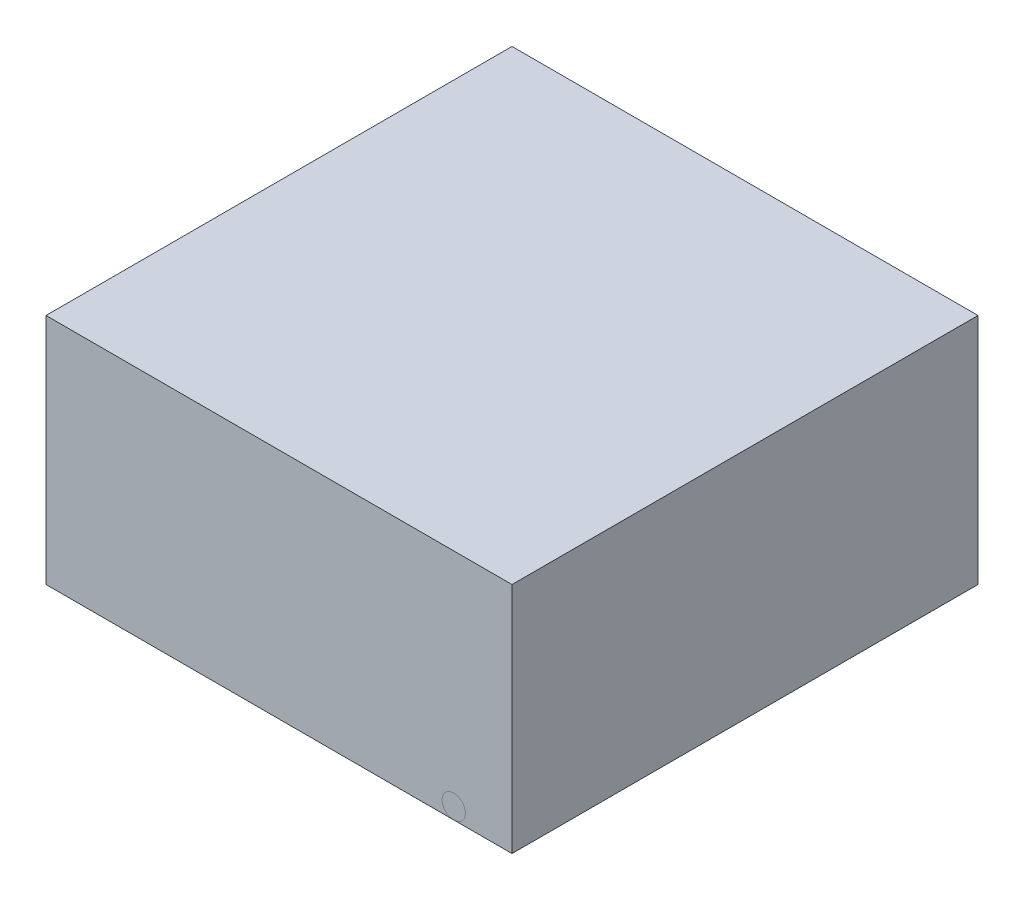
ISO-10303-21;
HEADER;
FILE_DESCRIPTION(('STEP AP214'),'2;1');
FILE_NAME('part.step','',(''),(''),'','','');
FILE_SCHEMA(('AUTOMOTIVE_DESIGN { 1 0 10303 214 1 1 1 1 }'));
ENDSEC;
DATA;
#1=APPLICATION_CONTEXT('core data for automotive mechanical design processes');
#2=APPLICATION_PROTOCOL_DEFINITION('international standard','automotive_design',2000,#1);
#3=PRODUCT_CONTEXT('',#1,'mechanical');
#4=PRODUCT('Part','Part','',(#3));
#5=PRODUCT_RELATED_PRODUCT_CATEGORY('part','',(#4));
#6=PRODUCT_DEFINITION_FORMATION('','',#4);
#7=PRODUCT_DEFINITION_CONTEXT('part definition',#1,'design');
#8=PRODUCT_DEFINITION('design','',#6,#7);
#9=PRODUCT_DEFINITION_SHAPE('','',#8);
#10=(LENGTH_UNIT() NAMED_UNIT(*) SI_UNIT(.MILLI.,.METRE.));
#11=(NAMED_UNIT(*) PLANE_ANGLE_UNIT() SI_UNIT($,.RADIAN.));
#12=(NAMED_UNIT(*) SI_UNIT($,.STERADIAN.) SOLID_ANGLE_UNIT());
#13=UNCERTAINTY_MEASURE_WITH_UNIT(LENGTH_MEASURE(1.E-05),#10,'distance_accuracy_value','');
#14=(GEOMETRIC_REPRESENTATION_CONTEXT(3) GLOBAL_UNCERTAINTY_ASSIGNED_CONTEXT((#13)) GLOBAL_UNIT_ASSIGNED_CONTEXT((#10,
#11,#12)) REPRESENTATION_CONTEXT('',''));
#15=CARTESIAN_POINT('',(0.,0.,0.));
#16=DIRECTION('',(0.,0.,1.));
#17=DIRECTION('',(1.,0.,0.));
#18=AXIS2_PLACEMENT_3D('',#15,#16,#17);
#19=CARTESIAN_POINT('',(-1.32978682457797,-4.7,12.0470966404881));
#20=CARTESIAN_POINT('',(-1.56949938233388,-4.7,12.2405123536894));
#21=CARTESIAN_POINT('',(-2.08614424851907,-4.7,12.5391697720833));
#22=CARTESIAN_POINT('',(-1.58643209411403,-4.7,13.1168891119311));
#23=CARTESIAN_POINT('',(-0.99479110722871,-4.7,13.4609601521511));
#24=CARTESIAN_POINT('',(-0.122057096544853,-4.7,13.5063472457396));
#25=CARTESIAN_POINT('',(0.780549472015395,-4.7,13.1044677868928));
#26=CARTESIAN_POINT('',(2.65290980881673,-4.7,13.5718372621998));
#27=CARTESIAN_POINT('',(1.37260667116618,-4.7,11.7465735610997));
#28=CARTESIAN_POINT('',(0.251281573482777,-4.7,11.3225744749199));
#29=CARTESIAN_POINT('',(-0.824147776626975,-4.7,11.5489578340658));
#30=CARTESIAN_POINT('',(-1.19634203116918,-4.7,11.9394246848268));
#31=CARTESIAN_POINT('',(-1.32978682457797,-4.7,12.0470966404881));
#32=B_SPLINE_CURVE_WITH_KNOTS('',3,(#19,#20,#21,#22,#23,#24,#25,#26,#27,#28,#29,#30,#31),
.UNSPECIFIED.,.T.,.F.,(4,1,1,1,1,1,1,1,1,1,4),(0.,0.0890314863366276,0.133435272323839,
0.204833870138696,0.315562123210451,0.38661889368764,0.538438655581061,0.696738525235763,
0.817182112999442,0.95043735542146,1.),.UNSPECIFIED.);
#33=DIRECTION('',(0.,-1.,0.));
#34=VECTOR('',#33,1.);
#35=SURFACE_OF_LINEAR_EXTRUSION('',#32,#34);
#36=CARTESIAN_POINT('',(-1.32978682457797,-4.7,12.0470966404881));
#37=VERTEX_POINT('',#36);
#38=EDGE_CURVE('E11',#37,#37,#32,.T.);
#39=ORIENTED_EDGE('',*,*,#38,.F.);
#40=EDGE_LOOP('',(#39));
#41=FACE_BOUND('',#40,.T.);
#42=CARTESIAN_POINT('',(-1.32978682457797,-5.,12.0470966404881));
#43=CARTESIAN_POINT('',(-1.56949938233388,-5.,12.2405123536894));
#44=CARTESIAN_POINT('',(-2.08614424851907,-5.,12.5391697720833));
#45=CARTESIAN_POINT('',(-1.58643209411403,-5.,13.1168891119311));
#46=CARTESIAN_POINT('',(-0.99479110722871,-5.,13.4609601521511));
#47=CARTESIAN_POINT('',(-0.122057096544853,-5.,13.5063472457396));
#48=CARTESIAN_POINT('',(0.780549472015395,-5.,13.1044677868928));
#49=CARTESIAN_POINT('',(2.65290980881673,-5.,13.5718372621998));
#50=CARTESIAN_POINT('',(1.37260667116618,-5.,11.7465735610997));
#51=CARTESIAN_POINT('',(0.251281573482777,-5.,11.3225744749199));
#52=CARTESIAN_POINT('',(-0.824147776626975,-5.,11.5489578340658));
#53=CARTESIAN_POINT('',(-1.19634203116918,-5.,11.9394246848268));
#54=CARTESIAN_POINT('',(-1.32978682457797,-5.,12.0470966404881));
#55=B_SPLINE_CURVE_WITH_KNOTS('',3,(#42,#43,#44,#45,#46,#47,#48,#49,#50,#51,#52,#53,#54),
.UNSPECIFIED.,.T.,.F.,(4,1,1,1,1,1,1,1,1,1,4),(0.,0.0890314863366276,0.133435272323839,
0.204833870138696,0.315562123210451,0.38661889368764,0.538438655581061,0.696738525235763,
0.817182112999442,0.95043735542146,1.),.UNSPECIFIED.);
#56=CARTESIAN_POINT('',(-1.32978682457797,-5.,12.0470966404881));
#57=VERTEX_POINT('',#56);
#58=EDGE_CURVE('E43',#57,#57,#55,.T.);
#59=ORIENTED_EDGE('',*,*,#58,.T.);
#60=EDGE_LOOP('',(#59));
#61=FACE_BOUND('',#60,.T.);
#62=ADVANCED_FACE('F39',(#41,#61),#35,.F.);
#63=CARTESIAN_POINT('',(1.81422588975815,-4.7,13.257386496687));
#64=DIRECTION('',(0.,-1.,0.));
#65=DIRECTION('',(0.,0.,-1.));
#66=AXIS2_PLACEMENT_3D('',#63,#64,#65);
#67=PLANE('',#66);
#68=ORIENTED_EDGE('',*,*,#38,.T.);
#69=EDGE_LOOP('',(#68));
#70=FACE_BOUND('',#69,.T.);
#71=ADVANCED_FACE('F62',(#70),#67,.F.);
#72=CARTESIAN_POINT('',(1.81422588975815,-5.,13.257386496687));
#73=DIRECTION('',(0.,-1.,0.));
#74=DIRECTION('',(0.,0.,-1.));
#75=AXIS2_PLACEMENT_3D('',#72,#73,#74);
#76=PLANE('',#75);
#77=ORIENTED_EDGE('',*,*,#58,.F.);
#78=EDGE_LOOP('',(#77));
#79=FACE_BOUND('',#78,.T.);
#80=ADVANCED_FACE('F60',(#79),#76,.T.);
#81=CLOSED_SHELL('',(#62,#71,#80));
#82=MANIFOLD_SOLID_BREP('B2',#81);
#83=CARTESIAN_POINT('',(7.5,-4.5,20.));
#84=DIRECTION('',(0.,0.,-1.));
#85=DIRECTION('',(-1.,0.,0.));
#86=AXIS2_PLACEMENT_3D('',#83,#84,#85);
#87=PLANE('',#86);
#88=CARTESIAN_POINT('',(7.5,-4.5,20.));
#89=DIRECTION('',(0.,0.,1.));
#90=DIRECTION('',(-1.,0.,0.));
#91=AXIS2_PLACEMENT_3D('',#88,#89,#90);
#92=CIRCLE('',#91,0.500000000000002);
#93=CARTESIAN_POINT('',(7.,-4.5,20.));
#94=VERTEX_POINT('',#93);
#95=EDGE_CURVE('E112',#94,#94,#92,.T.);
#96=ORIENTED_EDGE('',*,*,#95,.T.);
#97=EDGE_LOOP('',(#96));
#98=FACE_BOUND('',#97,.T.);
#99=ADVANCED_FACE('F98',(#98),#87,.F.);
#100=CARTESIAN_POINT('',(7.5,5.,4.));
#101=DIRECTION('',(0.,1.,0.));
#102=DIRECTION('',(-1.,0.,0.));
#103=AXIS2_PLACEMENT_3D('',#100,#101,#102);
#104=PLANE('',#103);
#105=CARTESIAN_POINT('',(7.5,5.,4.));
#106=DIRECTION('',(0.,-1.,0.));
#107=DIRECTION('',(-1.,0.,0.));
#108=AXIS2_PLACEMENT_3D('',#105,#106,#107);
#109=CIRCLE('',#108,0.500000000000002);
#110=CARTESIAN_POINT('',(7.,5.,4.));
#111=VERTEX_POINT('',#110);
#112=EDGE_CURVE('E38',#111,#111,#109,.T.);
#113=ORIENTED_EDGE('',*,*,#112,.F.);
#114=EDGE_LOOP('',(#113));
#115=FACE_BOUND('',#114,.T.);
#116=ADVANCED_FACE('F122',(#115),#104,.T.);
#117=CARTESIAN_POINT('',(7.5,-4.5,20.));
#118=DIRECTION('',(0.,0.,-1.));
#119=DIRECTION('',(-1.,0.,0.));
#120=AXIS2_PLACEMENT_3D('',#117,#118,#119);
#121=CYLINDRICAL_SURFACE('',#120,0.500000000000002);
#122=CARTESIAN_POINT('',(7.5,-4.5,5.));
#123=DIRECTION('',(0.,0.,1.));
#124=DIRECTION('',(-1.,0.,0.));
#125=AXIS2_PLACEMENT_3D('',#122,#123,#124);
#126=CIRCLE('',#125,0.500000000000002);
#127=CARTESIAN_POINT('',(7.5,-5.,5.));
#128=VERTEX_POINT('',#127);
#129=EDGE_CURVE('E108',#128,#128,#126,.T.);
#130=ORIENTED_EDGE('',*,*,#129,.T.);
#131=EDGE_LOOP('',(#130));
#132=FACE_BOUND('',#131,.T.);
#133=ORIENTED_EDGE('',*,*,#95,.F.);
#134=EDGE_LOOP('',(#133));
#135=FACE_BOUND('',#134,.T.);
#136=ADVANCED_FACE('F119',(#132,#135),#121,.T.);
#137=CARTESIAN_POINT('',(7.5,-3.5,5.));
#138=DIRECTION('',(1.,0.,0.));
#139=DIRECTION('',(0.,0.,-1.));
#140=AXIS2_PLACEMENT_3D('',#137,#138,#139);
#141=TOROIDAL_SURFACE('',#140,1.,0.500000000000002);
#142=CARTESIAN_POINT('',(7.5,-3.5,4.));
#143=DIRECTION('',(0.,-1.,0.));
#144=DIRECTION('',(-1.,0.,0.));
#145=AXIS2_PLACEMENT_3D('',#142,#143,#144);
#146=CIRCLE('',#145,0.500000000000002);
#147=CARTESIAN_POINT('',(7.5,-3.5,3.5));
#148=VERTEX_POINT('',#147);
#149=EDGE_CURVE('E104',#148,#148,#146,.T.);
#150=CARTESIAN_POINT('',(7.5,-3.5,5.));
#151=DIRECTION('',(1.,0.,0.));
#152=DIRECTION('',(0.,0.,-1.));
#153=AXIS2_PLACEMENT_3D('',#150,#151,#152);
#154=CIRCLE('',#153,1.5);
#155=EDGE_CURVE('',#128,#148,#154,.T.);
#156=ORIENTED_EDGE('',*,*,#129,.F.);
#157=ORIENTED_EDGE('',*,*,#149,.T.);
#158=ORIENTED_EDGE('',*,*,#155,.T.);
#159=ORIENTED_EDGE('',*,*,#155,.F.);
#160=EDGE_LOOP('',(#156,#158,#157,#159));
#161=FACE_BOUND('',#160,.T.);
#162=ADVANCED_FACE('F121',(#161),#141,.T.);
#163=CARTESIAN_POINT('',(7.5,-3.5,4.));
#164=DIRECTION('',(0.,1.,0.));
#165=DIRECTION('',(0.,0.,1.));
#166=AXIS2_PLACEMENT_3D('',#163,#164,#165);
#167=CYLINDRICAL_SURFACE('',#166,0.500000000000002);
#168=ORIENTED_EDGE('',*,*,#112,.T.);
#169=EDGE_LOOP('',(#168));
#170=FACE_BOUND('',#169,.T.);
#171=ORIENTED_EDGE('',*,*,#149,.F.);
#172=EDGE_LOOP('',(#171));
#173=FACE_BOUND('',#172,.T.);
#174=ADVANCED_FACE('F129',(#170,#173),#167,.T.);
#175=CLOSED_SHELL('',(#99,#116,#136,#162,#174));
#176=MANIFOLD_SOLID_BREP('B6',#175);
#177=CARTESIAN_POINT('',(-7.5,-4.5,20.));
#178=DIRECTION('',(0.,0.,1.));
#179=DIRECTION('',(1.,0.,0.));
#180=AXIS2_PLACEMENT_3D('',#177,#178,#179);
#181=PLANE('',#180);
#182=CARTESIAN_POINT('',(-7.5,-4.5,20.));
#183=DIRECTION('',(0.,0.,1.));
#184=DIRECTION('',(1.,0.,0.));
#185=AXIS2_PLACEMENT_3D('',#182,#183,#184);
#186=CIRCLE('',#185,0.500000000000002);
#187=CARTESIAN_POINT('',(-7.,-4.5,20.));
#188=VERTEX_POINT('',#187);
#189=EDGE_CURVE('E191',#188,#188,#186,.T.);
#190=ORIENTED_EDGE('',*,*,#189,.T.);
#191=EDGE_LOOP('',(#190));
#192=FACE_BOUND('',#191,.T.);
#193=ADVANCED_FACE('F177',(#192),#181,.T.);
#194=CARTESIAN_POINT('',(-7.5,5.,4.));
#195=DIRECTION('',(0.,-1.,0.));
#196=DIRECTION('',(1.,0.,0.));
#197=AXIS2_PLACEMENT_3D('',#194,#195,#196);
#198=PLANE('',#197);
#199=CARTESIAN_POINT('',(-7.5,5.,4.));
#200=DIRECTION('',(0.,-1.,0.));
#201=DIRECTION('',(1.,0.,0.));
#202=AXIS2_PLACEMENT_3D('',#199,#200,#201);
#203=CIRCLE('',#202,0.500000000000002);
#204=CARTESIAN_POINT('',(-7.,5.,4.));
#205=VERTEX_POINT('',#204);
#206=EDGE_CURVE('E97',#205,#205,#203,.T.);
#207=ORIENTED_EDGE('',*,*,#206,.F.);
#208=EDGE_LOOP('',(#207));
#209=FACE_BOUND('',#208,.T.);
#210=ADVANCED_FACE('F201',(#209),#198,.F.);
#211=CARTESIAN_POINT('',(-7.5,-4.5,20.));
#212=DIRECTION('',(0.,0.,-1.));
#213=DIRECTION('',(-1.,0.,0.));
#214=AXIS2_PLACEMENT_3D('',#211,#212,#213);
#215=CYLINDRICAL_SURFACE('',#214,0.500000000000002);
#216=CARTESIAN_POINT('',(-7.5,-4.5,5.));
#217=DIRECTION('',(0.,0.,1.));
#218=DIRECTION('',(1.,0.,0.));
#219=AXIS2_PLACEMENT_3D('',#216,#217,#218);
#220=CIRCLE('',#219,0.500000000000002);
#221=CARTESIAN_POINT('',(-7.5,-5.,5.));
#222=VERTEX_POINT('',#221);
#223=EDGE_CURVE('E187',#222,#222,#220,.T.);
#224=ORIENTED_EDGE('',*,*,#223,.T.);
#225=EDGE_LOOP('',(#224));
#226=FACE_BOUND('',#225,.T.);
#227=ORIENTED_EDGE('',*,*,#189,.F.);
#228=EDGE_LOOP('',(#227));
#229=FACE_BOUND('',#228,.T.);
#230=ADVANCED_FACE('F198',(#226,#229),#215,.T.);
#231=CARTESIAN_POINT('',(-7.5,-3.5,5.));
#232=DIRECTION('',(1.,0.,0.));
#233=DIRECTION('',(0.,0.,-1.));
#234=AXIS2_PLACEMENT_3D('',#231,#232,#233);
#235=TOROIDAL_SURFACE('',#234,1.,0.500000000000002);
#236=CARTESIAN_POINT('',(-7.5,-3.5,4.));
#237=DIRECTION('',(0.,-1.,0.));
#238=DIRECTION('',(1.,0.,0.));
#239=AXIS2_PLACEMENT_3D('',#236,#237,#238);
#240=CIRCLE('',#239,0.500000000000002);
#241=CARTESIAN_POINT('',(-7.5,-3.5,3.5));
#242=VERTEX_POINT('',#241);
#243=EDGE_CURVE('E183',#242,#242,#240,.T.);
#244=CARTESIAN_POINT('',(-7.5,-3.5,5.));
#245=DIRECTION('',(1.,0.,0.));
#246=DIRECTION('',(0.,0.,-1.));
#247=AXIS2_PLACEMENT_3D('',#244,#245,#246);
#248=CIRCLE('',#247,1.5);
#249=EDGE_CURVE('',#222,#242,#248,.T.);
#250=ORIENTED_EDGE('',*,*,#223,.F.);
#251=ORIENTED_EDGE('',*,*,#243,.T.);
#252=ORIENTED_EDGE('',*,*,#249,.T.);
#253=ORIENTED_EDGE('',*,*,#249,.F.);
#254=EDGE_LOOP('',(#250,#252,#251,#253));
#255=FACE_BOUND('',#254,.T.);
#256=ADVANCED_FACE('F200',(#255),#235,.T.);
#257=CARTESIAN_POINT('',(-7.5,-3.5,4.));
#258=DIRECTION('',(0.,1.,0.));
#259=DIRECTION('',(0.,0.,1.));
#260=AXIS2_PLACEMENT_3D('',#257,#258,#259);
#261=CYLINDRICAL_SURFACE('',#260,0.500000000000002);
#262=ORIENTED_EDGE('',*,*,#206,.T.);
#263=EDGE_LOOP('',(#262));
#264=FACE_BOUND('',#263,.T.);
#265=ORIENTED_EDGE('',*,*,#243,.F.);
#266=EDGE_LOOP('',(#265));
#267=FACE_BOUND('',#266,.T.);
#268=ADVANCED_FACE('F208',(#264,#267),#261,.T.);
#269=CLOSED_SHELL('',(#193,#210,#230,#256,#268));
#270=MANIFOLD_SOLID_BREP('B33',#269);
#271=CARTESIAN_POINT('',(10.,-5.,20.));
#272=DIRECTION('',(-1.,0.,0.));
#273=DIRECTION('',(0.,0.,1.));
#274=AXIS2_PLACEMENT_3D('',#271,#272,#273);
#275=PLANE('',#274);
#276=DIRECTION('',(0.,1.,0.));
#277=VECTOR('',#276,1.);
#278=CARTESIAN_POINT('',(10.,-5.,0.));
#279=LINE('',#278,#277);
#280=CARTESIAN_POINT('',(10.,-5.,0.));
#281=VERTEX_POINT('',#280);
#282=CARTESIAN_POINT('',(10.,5.,0.));
#283=VERTEX_POINT('',#282);
#284=EDGE_CURVE('E310',#281,#283,#279,.T.);
#285=ORIENTED_EDGE('',*,*,#284,.T.);
#286=DIRECTION('',(0.,0.,-1.));
#287=VECTOR('',#286,1.);
#288=CARTESIAN_POINT('',(10.,5.,20.));
#289=LINE('',#288,#287);
#290=CARTESIAN_POINT('',(10.,5.,20.));
#291=VERTEX_POINT('',#290);
#292=EDGE_CURVE('E175',#291,#283,#289,.T.);
#293=ORIENTED_EDGE('',*,*,#292,.F.);
#294=DIRECTION('',(0.,1.,0.));
#295=VECTOR('',#294,1.);
#296=CARTESIAN_POINT('',(10.,-5.,20.));
#297=LINE('',#296,#295);
#298=CARTESIAN_POINT('',(10.,-5.,20.));
#299=VERTEX_POINT('',#298);
#300=EDGE_CURVE('E298',#299,#291,#297,.T.);
#301=ORIENTED_EDGE('',*,*,#300,.F.);
#302=DIRECTION('',(0.,0.,-1.));
#303=VECTOR('',#302,1.);
#304=CARTESIAN_POINT('',(10.,-5.,20.));
#305=LINE('',#304,#303);
#306=EDGE_CURVE('E306',#299,#281,#305,.T.);
#307=ORIENTED_EDGE('',*,*,#306,.T.);
#308=EDGE_LOOP('',(#285,#293,#301,#307));
#309=FACE_BOUND('',#308,.T.);
#310=ADVANCED_FACE('F247',(#309),#275,.F.);
#311=CARTESIAN_POINT('',(-10.,5.,20.));
#312=DIRECTION('',(0.,-1.,0.));
#313=DIRECTION('',(0.,0.,-1.));
#314=AXIS2_PLACEMENT_3D('',#311,#312,#313);
#315=PLANE('',#314);
#316=DIRECTION('',(-1.,0.,0.));
#317=VECTOR('',#316,1.);
#318=CARTESIAN_POINT('',(-10.,5.,0.));
#319=LINE('',#318,#317);
#320=CARTESIAN_POINT('',(-10.,5.,0.));
#321=VERTEX_POINT('',#320);
#322=EDGE_CURVE('E302',#283,#321,#319,.T.);
#323=ORIENTED_EDGE('',*,*,#322,.T.);
#324=DIRECTION('',(0.,0.,-1.));
#325=VECTOR('',#324,1.);
#326=CARTESIAN_POINT('',(-10.,5.,20.));
#327=LINE('',#326,#325);
#328=CARTESIAN_POINT('',(-10.,5.,20.));
#329=VERTEX_POINT('',#328);
#330=EDGE_CURVE('E255',#329,#321,#327,.T.);
#331=ORIENTED_EDGE('',*,*,#330,.F.);
#332=DIRECTION('',(-1.,0.,0.));
#333=VECTOR('',#332,1.);
#334=CARTESIAN_POINT('',(-10.,5.,20.));
#335=LINE('',#334,#333);
#336=EDGE_CURVE('E293',#291,#329,#335,.T.);
#337=ORIENTED_EDGE('',*,*,#336,.F.);
#338=ORIENTED_EDGE('',*,*,#292,.T.);
#339=EDGE_LOOP('',(#323,#331,#337,#338));
#340=FACE_BOUND('',#339,.T.);
#341=ADVANCED_FACE('F301',(#340),#315,.F.);
#342=CARTESIAN_POINT('',(-10.,-5.,20.));
#343=DIRECTION('',(1.,0.,0.));
#344=DIRECTION('',(0.,1.,0.));
#345=AXIS2_PLACEMENT_3D('',#342,#343,#344);
#346=PLANE('',#345);
#347=DIRECTION('',(0.,-1.,0.));
#348=VECTOR('',#347,1.);
#349=CARTESIAN_POINT('',(-10.,-5.,0.));
#350=LINE('',#349,#348);
#351=CARTESIAN_POINT('',(-10.,-5.,0.));
#352=VERTEX_POINT('',#351);
#353=EDGE_CURVE('E280',#321,#352,#350,.T.);
#354=ORIENTED_EDGE('',*,*,#353,.T.);
#355=DIRECTION('',(0.,0.,-1.));
#356=VECTOR('',#355,1.);
#357=CARTESIAN_POINT('',(-10.,-5.,20.));
#358=LINE('',#357,#356);
#359=CARTESIAN_POINT('',(-10.,-5.,20.));
#360=VERTEX_POINT('',#359);
#361=EDGE_CURVE('E303',#360,#352,#358,.T.);
#362=ORIENTED_EDGE('',*,*,#361,.F.);
#363=DIRECTION('',(0.,-1.,0.));
#364=VECTOR('',#363,1.);
#365=CARTESIAN_POINT('',(-10.,-5.,20.));
#366=LINE('',#365,#364);
#367=EDGE_CURVE('E296',#329,#360,#366,.T.);
#368=ORIENTED_EDGE('',*,*,#367,.F.);
#369=ORIENTED_EDGE('',*,*,#330,.T.);
#370=EDGE_LOOP('',(#354,#362,#368,#369));
#371=FACE_BOUND('',#370,.T.);
#372=ADVANCED_FACE('F304',(#371),#346,.F.);
#373=CARTESIAN_POINT('',(-10.,-5.,20.));
#374=DIRECTION('',(0.,1.,0.));
#375=DIRECTION('',(0.,0.,1.));
#376=AXIS2_PLACEMENT_3D('',#373,#374,#375);
#377=PLANE('',#376);
#378=ORIENTED_EDGE('',*,*,#306,.F.);
#379=DIRECTION('',(1.,0.,0.));
#380=VECTOR('',#379,1.);
#381=CARTESIAN_POINT('',(-10.,-5.,20.));
#382=LINE('',#381,#380);
#383=EDGE_CURVE('E263',#360,#299,#382,.T.);
#384=ORIENTED_EDGE('',*,*,#383,.F.);
#385=ORIENTED_EDGE('',*,*,#361,.T.);
#386=DIRECTION('',(1.,0.,0.));
#387=VECTOR('',#386,1.);
#388=CARTESIAN_POINT('',(-10.,-5.,0.));
#389=LINE('',#388,#387);
#390=EDGE_CURVE('E286',#352,#281,#389,.T.);
#391=ORIENTED_EDGE('',*,*,#390,.T.);
#392=EDGE_LOOP('',(#378,#384,#385,#391));
#393=FACE_BOUND('',#392,.T.);
#394=ADVANCED_FACE('F317',(#393),#377,.F.);
#395=CARTESIAN_POINT('',(0.,0.,20.));
#396=DIRECTION('',(0.,0.,-1.));
#397=DIRECTION('',(-1.,0.,0.));
#398=AXIS2_PLACEMENT_3D('',#395,#396,#397);
#399=PLANE('',#398);
#400=ORIENTED_EDGE('',*,*,#383,.T.);
#401=ORIENTED_EDGE('',*,*,#300,.T.);
#402=ORIENTED_EDGE('',*,*,#336,.T.);
#403=ORIENTED_EDGE('',*,*,#367,.T.);
#404=EDGE_LOOP('',(#400,#401,#402,#403));
#405=FACE_BOUND('',#404,.T.);
#406=ADVANCED_FACE('F294',(#405),#399,.F.);
#407=CARTESIAN_POINT('',(0.,0.,0.));
#408=DIRECTION('',(0.,0.,-1.));
#409=DIRECTION('',(-1.,0.,0.));
#410=AXIS2_PLACEMENT_3D('',#407,#408,#409);
#411=PLANE('',#410);
#412=ORIENTED_EDGE('',*,*,#284,.F.);
#413=ORIENTED_EDGE('',*,*,#390,.F.);
#414=ORIENTED_EDGE('',*,*,#353,.F.);
#415=ORIENTED_EDGE('',*,*,#322,.F.);
#416=EDGE_LOOP('',(#412,#413,#414,#415));
#417=FACE_BOUND('',#416,.T.);
#418=ADVANCED_FACE('F320',(#417),#411,.T.);
#419=CLOSED_SHELL('',(#310,#341,#372,#394,#406,#418));
#420=MANIFOLD_SOLID_BREP('B92',#419);
#421=ADVANCED_BREP_SHAPE_REPRESENTATION('',(#18,#82,#176,#270,#420),#14);
#422=SHAPE_DEFINITION_REPRESENTATION(#9,#421);
ENDSEC;
END-ISO-10303-21;
